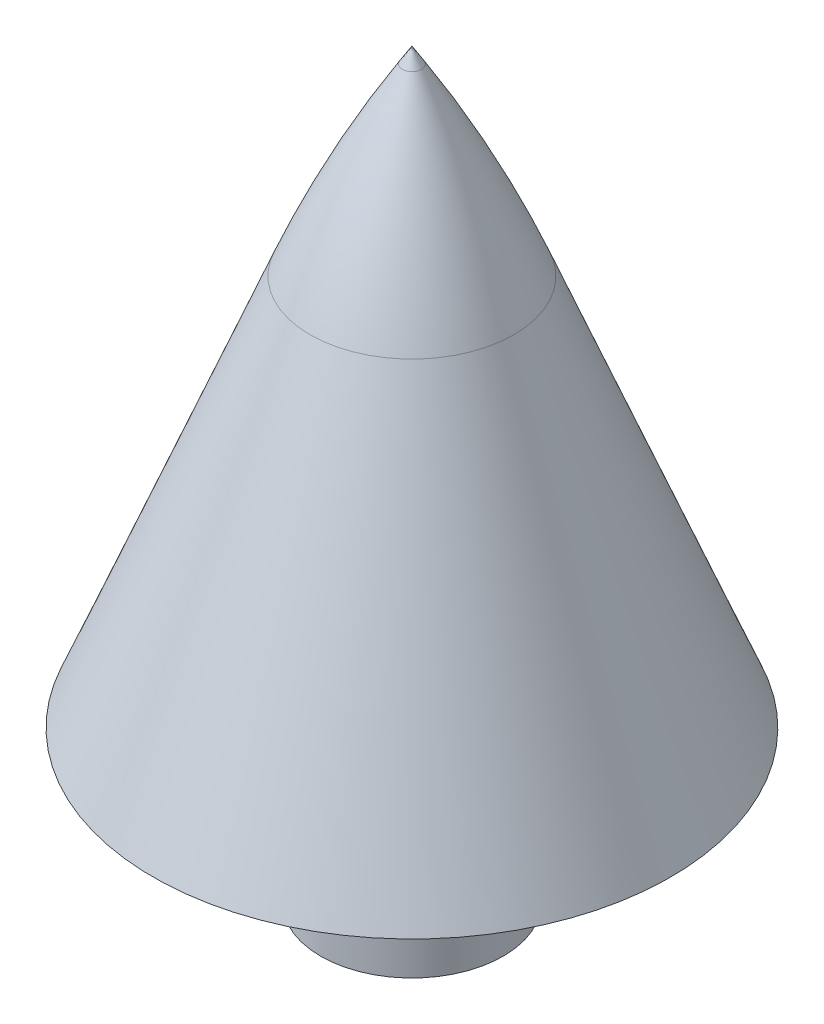
ISO-10303-21;
HEADER;
FILE_DESCRIPTION(('STEP AP214'),'2;1');
FILE_NAME('part.step','',(''),(''),'','','');
FILE_SCHEMA(('AUTOMOTIVE_DESIGN { 1 0 10303 214 1 1 1 1 }'));
ENDSEC;
DATA;
#1=APPLICATION_CONTEXT('core data for automotive mechanical design processes');
#2=APPLICATION_PROTOCOL_DEFINITION('international standard','automotive_design',2000,#1);
#3=PRODUCT_CONTEXT('',#1,'mechanical');
#4=PRODUCT('Part','Part','',(#3));
#5=PRODUCT_RELATED_PRODUCT_CATEGORY('part','',(#4));
#6=PRODUCT_DEFINITION_FORMATION('','',#4);
#7=PRODUCT_DEFINITION_CONTEXT('part definition',#1,'design');
#8=PRODUCT_DEFINITION('design','',#6,#7);
#9=PRODUCT_DEFINITION_SHAPE('','',#8);
#10=(LENGTH_UNIT() NAMED_UNIT(*) SI_UNIT(.MILLI.,.METRE.));
#11=(NAMED_UNIT(*) PLANE_ANGLE_UNIT() SI_UNIT($,.RADIAN.));
#12=(NAMED_UNIT(*) SI_UNIT($,.STERADIAN.) SOLID_ANGLE_UNIT());
#13=UNCERTAINTY_MEASURE_WITH_UNIT(LENGTH_MEASURE(1.E-05),#10,'distance_accuracy_value','');
#14=(GEOMETRIC_REPRESENTATION_CONTEXT(3) GLOBAL_UNCERTAINTY_ASSIGNED_CONTEXT((#13)) GLOBAL_UNIT_ASSIGNED_CONTEXT((#10,
#11,#12)) REPRESENTATION_CONTEXT('',''));
#15=CARTESIAN_POINT('',(0.,0.,0.));
#16=DIRECTION('',(0.,0.,1.));
#17=DIRECTION('',(1.,0.,0.));
#18=AXIS2_PLACEMENT_3D('',#15,#16,#17);
#19=CARTESIAN_POINT('',(0.,0.,0.));
#20=DIRECTION('',(0.,1.,0.));
#21=DIRECTION('',(0.,0.,1.));
#22=AXIS2_PLACEMENT_3D('',#19,#20,#21);
#23=PLANE('',#22);
#24=CARTESIAN_POINT('',(0.,0.,0.));
#25=DIRECTION('',(0.,1.,0.));
#26=DIRECTION('',(0.,0.,1.));
#27=AXIS2_PLACEMENT_3D('',#24,#25,#26);
#28=CIRCLE('',#27,3.);
#29=CARTESIAN_POINT('',(0.,0.,3.));
#30=VERTEX_POINT('',#29);
#31=EDGE_CURVE('E89',#30,#30,#28,.T.);
#32=ORIENTED_EDGE('',*,*,#31,.F.);
#33=EDGE_LOOP('',(#32));
#34=FACE_BOUND('',#33,.T.);
#35=CARTESIAN_POINT('',(0.,0.,0.));
#36=DIRECTION('',(0.,1.,0.));
#37=DIRECTION('',(0.,0.,1.));
#38=AXIS2_PLACEMENT_3D('',#35,#36,#37);
#39=CIRCLE('',#38,1.585);
#40=CARTESIAN_POINT('',(0.,0.,1.585));
#41=VERTEX_POINT('',#40);
#42=EDGE_CURVE('E85',#41,#41,#39,.T.);
#43=ORIENTED_EDGE('',*,*,#42,.T.);
#44=EDGE_LOOP('',(#43));
#45=FACE_BOUND('',#44,.T.);
#46=ADVANCED_FACE('F33',(#34,#45),#23,.F.);
#47=CARTESIAN_POINT('',(0.,5.,0.));
#48=DIRECTION('',(0.,-1.,0.));
#49=DIRECTION('',(0.,0.,-1.));
#50=AXIS2_PLACEMENT_3D('',#47,#48,#49);
#51=CYLINDRICAL_SURFACE('',#50,3.);
#52=CARTESIAN_POINT('',(0.,5.,0.));
#53=DIRECTION('',(0.,1.,0.));
#54=DIRECTION('',(0.,0.,1.));
#55=AXIS2_PLACEMENT_3D('',#52,#53,#54);
#56=CIRCLE('',#55,3.);
#57=CARTESIAN_POINT('',(0.,5.,3.));
#58=VERTEX_POINT('',#57);
#59=EDGE_CURVE('E80',#58,#58,#56,.T.);
#60=ORIENTED_EDGE('',*,*,#59,.F.);
#61=EDGE_LOOP('',(#60));
#62=FACE_BOUND('',#61,.T.);
#63=ORIENTED_EDGE('',*,*,#31,.T.);
#64=EDGE_LOOP('',(#63));
#65=FACE_BOUND('',#64,.T.);
#66=ADVANCED_FACE('F59',(#62,#65),#51,.T.);
#67=CARTESIAN_POINT('',(0.,5.,0.));
#68=DIRECTION('',(0.,-1.,0.));
#69=DIRECTION('',(0.,0.,-1.));
#70=AXIS2_PLACEMENT_3D('',#67,#68,#69);
#71=CYLINDRICAL_SURFACE('',#70,1.585);
#72=ORIENTED_EDGE('',*,*,#42,.F.);
#73=EDGE_LOOP('',(#72));
#74=FACE_BOUND('',#73,.T.);
#75=CARTESIAN_POINT('',(0.,12.,0.));
#76=DIRECTION('',(0.,-1.,0.));
#77=DIRECTION('',(0.,0.,-1.));
#78=AXIS2_PLACEMENT_3D('',#75,#76,#77);
#79=CIRCLE('',#78,1.585);
#80=CARTESIAN_POINT('',(0.,12.,-1.585));
#81=VERTEX_POINT('',#80);
#82=EDGE_CURVE('E86',#81,#81,#79,.T.);
#83=ORIENTED_EDGE('',*,*,#82,.F.);
#84=EDGE_LOOP('',(#83));
#85=FACE_BOUND('',#84,.T.);
#86=ADVANCED_FACE('F65',(#74,#85),#71,.F.);
#87=CARTESIAN_POINT('',(0.,5.,0.));
#88=DIRECTION('',(0.,-1.,0.));
#89=DIRECTION('',(0.,0.,-1.));
#90=AXIS2_PLACEMENT_3D('',#87,#88,#89);
#91=PLANE('',#90);
#92=ORIENTED_EDGE('',*,*,#59,.T.);
#93=EDGE_LOOP('',(#92));
#94=FACE_BOUND('',#93,.T.);
#95=CARTESIAN_POINT('',(0.,5.,0.));
#96=DIRECTION('',(0.,-1.,0.));
#97=DIRECTION('',(0.,0.,-1.));
#98=AXIS2_PLACEMENT_3D('',#95,#96,#97);
#99=CIRCLE('',#98,8.5);
#100=CARTESIAN_POINT('',(0.,5.,-8.5));
#101=VERTEX_POINT('',#100);
#102=EDGE_CURVE('E83',#101,#101,#99,.T.);
#103=ORIENTED_EDGE('',*,*,#102,.T.);
#104=EDGE_LOOP('',(#103));
#105=FACE_BOUND('',#104,.T.);
#106=ADVANCED_FACE('F54',(#94,#105),#91,.T.);
#107=CARTESIAN_POINT('',(0.,5.,0.));
#108=DIRECTION('',(0.,-1.,0.));
#109=DIRECTION('',(0.,0.,-1.));
#110=AXIS2_PLACEMENT_3D('',#107,#108,#109);
#111=CONICAL_SURFACE('',#110,8.5,0.381314305407973);
#112=CARTESIAN_POINT('',(0.,17.8549324416731,0.));
#113=DIRECTION('',(0.,1.,0.));
#114=DIRECTION('',(0.,0.,1.));
#115=AXIS2_PLACEMENT_3D('',#112,#113,#114);
#116=CIRCLE('',#115,3.34597552416668);
#117=CARTESIAN_POINT('',(0.,17.8549324416731,3.34597552416668));
#118=VERTEX_POINT('',#117);
#119=EDGE_CURVE('E40',#118,#118,#116,.F.);
#120=ORIENTED_EDGE('',*,*,#119,.T.);
#121=EDGE_LOOP('',(#120));
#122=FACE_BOUND('',#121,.T.);
#123=ORIENTED_EDGE('',*,*,#102,.F.);
#124=EDGE_LOOP('',(#123));
#125=FACE_BOUND('',#124,.T.);
#126=ADVANCED_FACE('F45',(#122,#125),#111,.T.);
#127=CARTESIAN_POINT('',(0.,21.,0.));
#128=DIRECTION('',(0.,-1.,0.));
#129=DIRECTION('',(0.,0.,-1.));
#130=AXIS2_PLACEMENT_3D('',#127,#128,#129);
#131=CONICAL_SURFACE('',#130,2.085,0.550332666324034);
#132=CARTESIAN_POINT('',(0.,23.8881367837392,0.));
#133=DIRECTION('',(0.,1.,0.));
#134=DIRECTION('',(0.,0.,1.));
#135=AXIS2_PLACEMENT_3D('',#132,#133,#134);
#136=CIRCLE('',#135,0.312946068145636);
#137=CARTESIAN_POINT('',(0.,23.8881367837392,0.312946068145636));
#138=VERTEX_POINT('',#137);
#139=EDGE_CURVE('E11',#138,#138,#136,.T.);
#140=ORIENTED_EDGE('',*,*,#139,.T.);
#141=EDGE_LOOP('',(#140));
#142=FACE_BOUND('',#141,.T.);
#143=CARTESIAN_POINT('',(0.,24.3981839298733,0.));
#144=VERTEX_POINT('',#143);
#145=VERTEX_LOOP('',#144);
#146=FACE_BOUND('',#145,.T.);
#147=ADVANCED_FACE('F43',(#142,#146),#131,.T.);
#148=CARTESIAN_POINT('',(0.,2.96930453564933,0.));
#149=DIRECTION('',(0.,1.,0.));
#150=DIRECTION('',(0.,0.,1.));
#151=AXIS2_PLACEMENT_3D('',#148,#149,#150);
#152=DEGENERATE_TOROIDAL_SURFACE('',#151,33.7810777098755,40.,.F.);
#153=ORIENTED_EDGE('',*,*,#139,.F.);
#154=EDGE_LOOP('',(#153));
#155=FACE_BOUND('',#154,.T.);
#156=ORIENTED_EDGE('',*,*,#119,.F.);
#157=EDGE_LOOP('',(#156));
#158=FACE_BOUND('',#157,.T.);
#159=ADVANCED_FACE('F35',(#155,#158),#152,.F.);
#160=CARTESIAN_POINT('',(0.,12.,0.));
#161=DIRECTION('',(0.,-1.,0.));
#162=DIRECTION('',(0.,0.,-1.));
#163=AXIS2_PLACEMENT_3D('',#160,#161,#162);
#164=PLANE('',#163);
#165=ORIENTED_EDGE('',*,*,#82,.T.);
#166=EDGE_LOOP('',(#165));
#167=FACE_BOUND('',#166,.T.);
#168=ADVANCED_FACE('F52',(#167),#164,.T.);
#169=CLOSED_SHELL('',(#46,#66,#86,#106,#126,#147,#159,#168));
#170=MANIFOLD_SOLID_BREP('B2',#169);
#171=ADVANCED_BREP_SHAPE_REPRESENTATION('',(#18,#170),#14);
#172=SHAPE_DEFINITION_REPRESENTATION(#9,#171);
ENDSEC;
END-ISO-10303-21;
